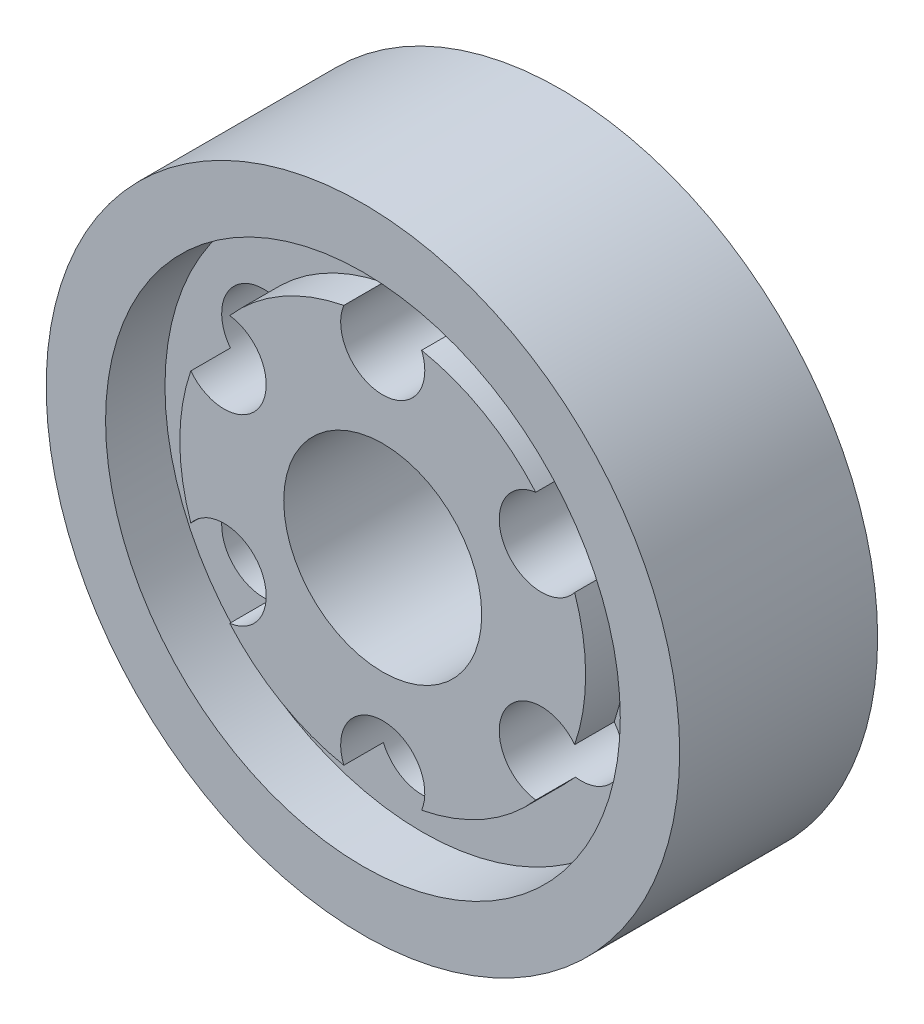
ISO-10303-21;
HEADER;
FILE_DESCRIPTION(('STEP AP214'),'2;1');
FILE_NAME('part.step','',(''),(''),'','','');
FILE_SCHEMA(('AUTOMOTIVE_DESIGN { 1 0 10303 214 1 1 1 1 }'));
ENDSEC;
DATA;
#1=APPLICATION_CONTEXT('core data for automotive mechanical design processes');
#2=APPLICATION_PROTOCOL_DEFINITION('international standard','automotive_design',2000,#1);
#3=PRODUCT_CONTEXT('',#1,'mechanical');
#4=PRODUCT('Part','Part','',(#3));
#5=PRODUCT_RELATED_PRODUCT_CATEGORY('part','',(#4));
#6=PRODUCT_DEFINITION_FORMATION('','',#4);
#7=PRODUCT_DEFINITION_CONTEXT('part definition',#1,'design');
#8=PRODUCT_DEFINITION('design','',#6,#7);
#9=PRODUCT_DEFINITION_SHAPE('','',#8);
#10=(LENGTH_UNIT() NAMED_UNIT(*) SI_UNIT(.MILLI.,.METRE.));
#11=(NAMED_UNIT(*) PLANE_ANGLE_UNIT() SI_UNIT($,.RADIAN.));
#12=(NAMED_UNIT(*) SI_UNIT($,.STERADIAN.) SOLID_ANGLE_UNIT());
#13=UNCERTAINTY_MEASURE_WITH_UNIT(LENGTH_MEASURE(1.E-05),#10,'distance_accuracy_value','');
#14=(GEOMETRIC_REPRESENTATION_CONTEXT(3) GLOBAL_UNCERTAINTY_ASSIGNED_CONTEXT((#13)) GLOBAL_UNIT_ASSIGNED_CONTEXT((#10,
#11,#12)) REPRESENTATION_CONTEXT('',''));
#15=CARTESIAN_POINT('',(0.,0.,0.));
#16=DIRECTION('',(0.,0.,1.));
#17=DIRECTION('',(1.,0.,0.));
#18=AXIS2_PLACEMENT_3D('',#15,#16,#17);
#19=CARTESIAN_POINT('',(0.,0.,18.));
#20=DIRECTION('',(0.,0.,-1.));
#21=DIRECTION('',(-1.,0.,0.));
#22=AXIS2_PLACEMENT_3D('',#19,#20,#21);
#23=CYLINDRICAL_SURFACE('',#22,20.5);
#24=CARTESIAN_POINT('',(0.,0.,14.));
#25=DIRECTION('',(0.,0.,1.));
#26=DIRECTION('',(1.,0.,0.));
#27=AXIS2_PLACEMENT_3D('',#24,#25,#26);
#28=CIRCLE('',#27,20.5);
#29=CARTESIAN_POINT('',(19.3889539201822,-6.65721156949741,14.));
#30=VERTEX_POINT('',#29);
#31=CARTESIAN_POINT('',(19.3889539201821,6.65721156949783,14.));
#32=VERTEX_POINT('',#31);
#33=EDGE_CURVE('E129',#30,#32,#28,.T.);
#34=ORIENTED_EDGE('',*,*,#33,.T.);
#35=DIRECTION('',(0.,0.,1.));
#36=VECTOR('',#35,1.);
#37=CARTESIAN_POINT('',(19.3889539201821,6.65721156949782,9.));
#38=LINE('',#37,#36);
#39=CARTESIAN_POINT('',(19.3889539201821,6.65721156949783,18.));
#40=VERTEX_POINT('',#39);
#41=EDGE_CURVE('E119',#32,#40,#38,.T.);
#42=ORIENTED_EDGE('',*,*,#41,.T.);
#43=CARTESIAN_POINT('',(0.,0.,18.));
#44=DIRECTION('',(0.,0.,1.));
#45=DIRECTION('',(1.,0.,0.));
#46=AXIS2_PLACEMENT_3D('',#43,#44,#45);
#47=CIRCLE('',#46,20.5);
#48=CARTESIAN_POINT('',(19.3889539201822,-6.65721156949742,18.));
#49=VERTEX_POINT('',#48);
#50=EDGE_CURVE('E127',#49,#40,#47,.T.);
#51=ORIENTED_EDGE('',*,*,#50,.F.);
#52=DIRECTION('',(0.,0.,1.));
#53=VECTOR('',#52,1.);
#54=CARTESIAN_POINT('',(19.3889539201822,-6.65721156949742,9.));
#55=LINE('',#54,#53);
#56=EDGE_CURVE('E54',#49,#30,#55,.F.);
#57=ORIENTED_EDGE('',*,*,#56,.T.);
#58=EDGE_LOOP('',(#34,#42,#51,#57));
#59=FACE_BOUND('',#58,.T.);
#60=ADVANCED_FACE('F32',(#59),#23,.T.);
#61=CARTESIAN_POINT('',(3.92916262253849,-20.1199324324324,14.));
#62=VERTEX_POINT('',#61);
#63=CARTESIAN_POINT('',(15.4597912976438,-13.4627208629347,14.));
#64=VERTEX_POINT('',#63);
#65=EDGE_CURVE('E182',#62,#64,#28,.T.);
#66=ORIENTED_EDGE('',*,*,#65,.T.);
#67=DIRECTION('',(0.,0.,1.));
#68=VECTOR('',#67,1.);
#69=CARTESIAN_POINT('',(15.4597912976438,-13.4627208629347,9.));
#70=LINE('',#69,#68);
#71=CARTESIAN_POINT('',(15.4597912976438,-13.4627208629347,18.));
#72=VERTEX_POINT('',#71);
#73=EDGE_CURVE('E174',#64,#72,#70,.T.);
#74=ORIENTED_EDGE('',*,*,#73,.T.);
#75=CARTESIAN_POINT('',(3.92916262253849,-20.1199324324324,18.));
#76=VERTEX_POINT('',#75);
#77=EDGE_CURVE('E136',#76,#72,#47,.T.);
#78=ORIENTED_EDGE('',*,*,#77,.F.);
#79=DIRECTION('',(0.,0.,1.));
#80=VECTOR('',#79,1.);
#81=CARTESIAN_POINT('',(3.92916262253849,-20.1199324324324,9.));
#82=LINE('',#81,#80);
#83=EDGE_CURVE('E195',#76,#62,#82,.F.);
#84=ORIENTED_EDGE('',*,*,#83,.T.);
#85=EDGE_LOOP('',(#66,#74,#78,#84));
#86=FACE_BOUND('',#85,.T.);
#87=ADVANCED_FACE('F179',(#86),#23,.T.);
#88=CARTESIAN_POINT('',(-15.4597912976436,-13.4627208629349,14.));
#89=VERTEX_POINT('',#88);
#90=CARTESIAN_POINT('',(-3.92916262253849,-20.1199324324324,14.));
#91=VERTEX_POINT('',#90);
#92=EDGE_CURVE('E201',#89,#91,#28,.T.);
#93=ORIENTED_EDGE('',*,*,#92,.T.);
#94=DIRECTION('',(0.,0.,1.));
#95=VECTOR('',#94,1.);
#96=CARTESIAN_POINT('',(-3.92916262253849,-20.1199324324324,9.));
#97=LINE('',#96,#95);
#98=CARTESIAN_POINT('',(-3.92916262253849,-20.1199324324324,18.));
#99=VERTEX_POINT('',#98);
#100=EDGE_CURVE('E193',#91,#99,#97,.T.);
#101=ORIENTED_EDGE('',*,*,#100,.T.);
#102=CARTESIAN_POINT('',(-15.4597912976436,-13.4627208629349,18.));
#103=VERTEX_POINT('',#102);
#104=EDGE_CURVE('E139',#103,#99,#47,.T.);
#105=ORIENTED_EDGE('',*,*,#104,.F.);
#106=DIRECTION('',(0.,0.,1.));
#107=VECTOR('',#106,1.);
#108=CARTESIAN_POINT('',(-15.4597912976436,-13.4627208629349,9.));
#109=LINE('',#108,#107);
#110=EDGE_CURVE('E206',#103,#89,#109,.F.);
#111=ORIENTED_EDGE('',*,*,#110,.T.);
#112=EDGE_LOOP('',(#93,#101,#105,#111));
#113=FACE_BOUND('',#112,.T.);
#114=ADVANCED_FACE('F198',(#113),#23,.T.);
#115=CARTESIAN_POINT('',(-19.3889539201822,6.65721156949755,14.));
#116=VERTEX_POINT('',#115);
#117=CARTESIAN_POINT('',(-19.3889539201821,-6.65721156949769,14.));
#118=VERTEX_POINT('',#117);
#119=EDGE_CURVE('E151',#116,#118,#28,.T.);
#120=ORIENTED_EDGE('',*,*,#119,.T.);
#121=DIRECTION('',(0.,0.,1.));
#122=VECTOR('',#121,1.);
#123=CARTESIAN_POINT('',(-19.3889539201821,-6.65721156949769,9.));
#124=LINE('',#123,#122);
#125=CARTESIAN_POINT('',(-19.3889539201821,-6.65721156949769,18.));
#126=VERTEX_POINT('',#125);
#127=EDGE_CURVE('E214',#118,#126,#124,.T.);
#128=ORIENTED_EDGE('',*,*,#127,.T.);
#129=CARTESIAN_POINT('',(-19.3889539201822,6.65721156949755,18.));
#130=VERTEX_POINT('',#129);
#131=EDGE_CURVE('E146',#130,#126,#47,.T.);
#132=ORIENTED_EDGE('',*,*,#131,.F.);
#133=DIRECTION('',(0.,0.,1.));
#134=VECTOR('',#133,1.);
#135=CARTESIAN_POINT('',(-19.3889539201822,6.65721156949755,9.));
#136=LINE('',#135,#134);
#137=EDGE_CURVE('E220',#130,#116,#136,.F.);
#138=ORIENTED_EDGE('',*,*,#137,.T.);
#139=EDGE_LOOP('',(#120,#128,#132,#138));
#140=FACE_BOUND('',#139,.T.);
#141=ADVANCED_FACE('F251',(#140),#23,.T.);
#142=CARTESIAN_POINT('',(-3.92916262253849,20.1199324324324,14.));
#143=VERTEX_POINT('',#142);
#144=CARTESIAN_POINT('',(-15.4597912976437,13.4627208629348,14.));
#145=VERTEX_POINT('',#144);
#146=EDGE_CURVE('E140',#143,#145,#28,.T.);
#147=ORIENTED_EDGE('',*,*,#146,.T.);
#148=DIRECTION('',(0.,0.,1.));
#149=VECTOR('',#148,1.);
#150=CARTESIAN_POINT('',(-15.4597912976437,13.4627208629348,9.));
#151=LINE('',#150,#149);
#152=CARTESIAN_POINT('',(-15.4597912976437,13.4627208629348,18.));
#153=VERTEX_POINT('',#152);
#154=EDGE_CURVE('E225',#145,#153,#151,.T.);
#155=ORIENTED_EDGE('',*,*,#154,.T.);
#156=CARTESIAN_POINT('',(-3.92916262253849,20.1199324324324,18.));
#157=VERTEX_POINT('',#156);
#158=EDGE_CURVE('E141',#157,#153,#47,.T.);
#159=ORIENTED_EDGE('',*,*,#158,.F.);
#160=DIRECTION('',(0.,0.,1.));
#161=VECTOR('',#160,1.);
#162=CARTESIAN_POINT('',(-3.92916262253849,20.1199324324324,9.));
#163=LINE('',#162,#161);
#164=EDGE_CURVE('E231',#157,#143,#163,.F.);
#165=ORIENTED_EDGE('',*,*,#164,.T.);
#166=EDGE_LOOP('',(#147,#155,#159,#165));
#167=FACE_BOUND('',#166,.T.);
#168=ADVANCED_FACE('F268',(#167),#23,.T.);
#169=CARTESIAN_POINT('',(0.,0.,14.));
#170=DIRECTION('',(0.,0.,1.));
#171=DIRECTION('',(1.,0.,0.));
#172=AXIS2_PLACEMENT_3D('',#169,#170,#171);
#173=PLANE('',#172);
#174=CARTESIAN_POINT('',(16.021469970012,9.25000000000019,14.));
#175=DIRECTION('',(0.,0.,1.));
#176=DIRECTION('',(1.,0.,0.));
#177=AXIS2_PLACEMENT_3D('',#174,#175,#176);
#178=CIRCLE('',#177,4.25);
#179=CARTESIAN_POINT('',(15.4597912976435,13.462720862935,14.));
#180=VERTEX_POINT('',#179);
#181=EDGE_CURVE('E131',#32,#180,#178,.T.);
#182=ORIENTED_EDGE('',*,*,#181,.F.);
#183=ORIENTED_EDGE('',*,*,#33,.F.);
#184=CARTESIAN_POINT('',(16.0214699700122,-9.24999999999985,14.));
#185=DIRECTION('',(0.,0.,1.));
#186=DIRECTION('',(1.,0.,0.));
#187=AXIS2_PLACEMENT_3D('',#184,#185,#186);
#188=CIRCLE('',#187,4.25);
#189=EDGE_CURVE('E184',#64,#30,#188,.T.);
#190=ORIENTED_EDGE('',*,*,#189,.F.);
#191=ORIENTED_EDGE('',*,*,#65,.F.);
#192=CARTESIAN_POINT('',(0.,-18.5,14.));
#193=DIRECTION('',(0.,0.,1.));
#194=DIRECTION('',(1.,0.,0.));
#195=AXIS2_PLACEMENT_3D('',#192,#193,#194);
#196=CIRCLE('',#195,4.25);
#197=EDGE_CURVE('E203',#91,#62,#196,.T.);
#198=ORIENTED_EDGE('',*,*,#197,.F.);
#199=ORIENTED_EDGE('',*,*,#92,.F.);
#200=CARTESIAN_POINT('',(-16.0214699700121,-9.25000000000008,14.));
#201=DIRECTION('',(0.,0.,1.));
#202=DIRECTION('',(1.,0.,0.));
#203=AXIS2_PLACEMENT_3D('',#200,#201,#202);
#204=CIRCLE('',#203,4.25);
#205=EDGE_CURVE('E212',#118,#89,#204,.T.);
#206=ORIENTED_EDGE('',*,*,#205,.F.);
#207=ORIENTED_EDGE('',*,*,#119,.F.);
#208=CARTESIAN_POINT('',(-16.0214699700121,9.24999999999996,14.));
#209=DIRECTION('',(0.,0.,1.));
#210=DIRECTION('',(1.,0.,0.));
#211=AXIS2_PLACEMENT_3D('',#208,#209,#210);
#212=CIRCLE('',#211,4.25);
#213=EDGE_CURVE('E223',#145,#116,#212,.T.);
#214=ORIENTED_EDGE('',*,*,#213,.F.);
#215=ORIENTED_EDGE('',*,*,#146,.F.);
#216=CARTESIAN_POINT('',(0.,18.5,14.));
#217=DIRECTION('',(0.,0.,1.));
#218=DIRECTION('',(1.,0.,0.));
#219=AXIS2_PLACEMENT_3D('',#216,#217,#218);
#220=CIRCLE('',#219,4.25);
#221=CARTESIAN_POINT('',(3.92916262253849,20.1199324324324,14.));
#222=VERTEX_POINT('',#221);
#223=EDGE_CURVE('E234',#222,#143,#220,.T.);
#224=ORIENTED_EDGE('',*,*,#223,.F.);
#225=EDGE_CURVE('E152',#180,#222,#28,.T.);
#226=ORIENTED_EDGE('',*,*,#225,.F.);
#227=EDGE_LOOP('',(#182,#183,#190,#191,#198,#199,#206,#207,#214,#215,#224,#226));
#228=FACE_BOUND('',#227,.T.);
#229=CARTESIAN_POINT('',(0.,0.,14.));
#230=DIRECTION('',(0.,0.,1.));
#231=DIRECTION('',(1.,0.,0.));
#232=AXIS2_PLACEMENT_3D('',#229,#230,#231);
#233=CIRCLE('',#232,26.);
#234=CARTESIAN_POINT('',(26.,0.,14.));
#235=VERTEX_POINT('',#234);
#236=EDGE_CURVE('E153',#235,#235,#233,.T.);
#237=ORIENTED_EDGE('',*,*,#236,.T.);
#238=EDGE_LOOP('',(#237));
#239=FACE_BOUND('',#238,.T.);
#240=ADVANCED_FACE('F257',(#228,#239),#173,.T.);
#241=CARTESIAN_POINT('',(0.,0.,20.));
#242=DIRECTION('',(0.,0.,-1.));
#243=DIRECTION('',(-1.,0.,0.));
#244=AXIS2_PLACEMENT_3D('',#241,#242,#243);
#245=CYLINDRICAL_SURFACE('',#244,32.);
#246=CARTESIAN_POINT('',(0.,0.,20.));
#247=DIRECTION('',(0.,0.,1.));
#248=DIRECTION('',(1.,0.,0.));
#249=AXIS2_PLACEMENT_3D('',#246,#247,#248);
#250=CIRCLE('',#249,32.);
#251=CARTESIAN_POINT('',(32.,0.,20.));
#252=VERTEX_POINT('',#251);
#253=EDGE_CURVE('E159',#252,#252,#250,.T.);
#254=ORIENTED_EDGE('',*,*,#253,.F.);
#255=EDGE_LOOP('',(#254));
#256=FACE_BOUND('',#255,.T.);
#257=CARTESIAN_POINT('',(0.,0.,0.));
#258=DIRECTION('',(0.,0.,1.));
#259=DIRECTION('',(1.,0.,0.));
#260=AXIS2_PLACEMENT_3D('',#257,#258,#259);
#261=CIRCLE('',#260,32.);
#262=CARTESIAN_POINT('',(32.,0.,0.));
#263=VERTEX_POINT('',#262);
#264=EDGE_CURVE('E156',#263,#263,#261,.T.);
#265=ORIENTED_EDGE('',*,*,#264,.T.);
#266=EDGE_LOOP('',(#265));
#267=FACE_BOUND('',#266,.T.);
#268=ADVANCED_FACE('F34',(#256,#267),#245,.T.);
#269=CARTESIAN_POINT('',(0.,0.,20.));
#270=DIRECTION('',(0.,0.,1.));
#271=DIRECTION('',(1.,0.,0.));
#272=AXIS2_PLACEMENT_3D('',#269,#270,#271);
#273=PLANE('',#272);
#274=CARTESIAN_POINT('',(0.,0.,20.));
#275=DIRECTION('',(0.,0.,1.));
#276=DIRECTION('',(1.,0.,0.));
#277=AXIS2_PLACEMENT_3D('',#274,#275,#276);
#278=CIRCLE('',#277,26.);
#279=CARTESIAN_POINT('',(26.,0.,20.));
#280=VERTEX_POINT('',#279);
#281=EDGE_CURVE('E145',#280,#280,#278,.T.);
#282=ORIENTED_EDGE('',*,*,#281,.F.);
#283=EDGE_LOOP('',(#282));
#284=FACE_BOUND('',#283,.T.);
#285=ORIENTED_EDGE('',*,*,#253,.T.);
#286=EDGE_LOOP('',(#285));
#287=FACE_BOUND('',#286,.T.);
#288=ADVANCED_FACE('F368',(#284,#287),#273,.T.);
#289=CARTESIAN_POINT('',(0.,0.,0.));
#290=DIRECTION('',(0.,0.,1.));
#291=DIRECTION('',(1.,0.,0.));
#292=AXIS2_PLACEMENT_3D('',#289,#290,#291);
#293=PLANE('',#292);
#294=CARTESIAN_POINT('',(16.021469970012,9.25000000000019,0.));
#295=DIRECTION('',(0.,0.,1.));
#296=DIRECTION('',(0.50000000000001,-0.866025403784433,0.));
#297=AXIS2_PLACEMENT_3D('',#294,#295,#296);
#298=CIRCLE('',#297,4.25);
#299=CARTESIAN_POINT('',(18.1464699700121,5.56939203391635,0.));
#300=VERTEX_POINT('',#299);
#301=EDGE_CURVE('E273',#300,#300,#298,.T.);
#302=ORIENTED_EDGE('',*,*,#301,.T.);
#303=EDGE_LOOP('',(#302));
#304=FACE_BOUND('',#303,.T.);
#305=CARTESIAN_POINT('',(16.0214699700122,-9.24999999999985,0.));
#306=DIRECTION('',(0.,0.,1.));
#307=DIRECTION('',(-0.499999999999992,-0.866025403784443,0.));
#308=AXIS2_PLACEMENT_3D('',#305,#306,#307);
#309=CIRCLE('',#308,4.25);
#310=CARTESIAN_POINT('',(13.8964699700122,-12.9306079660837,0.));
#311=VERTEX_POINT('',#310);
#312=EDGE_CURVE('E130',#311,#311,#309,.T.);
#313=ORIENTED_EDGE('',*,*,#312,.T.);
#314=EDGE_LOOP('',(#313));
#315=FACE_BOUND('',#314,.T.);
#316=CARTESIAN_POINT('',(0.,-18.5,0.));
#317=DIRECTION('',(0.,0.,1.));
#318=DIRECTION('',(-1.,0.,0.));
#319=AXIS2_PLACEMENT_3D('',#316,#317,#318);
#320=CIRCLE('',#319,4.25);
#321=CARTESIAN_POINT('',(-4.25,-18.5,0.));
#322=VERTEX_POINT('',#321);
#323=EDGE_CURVE('E183',#322,#322,#320,.T.);
#324=ORIENTED_EDGE('',*,*,#323,.T.);
#325=EDGE_LOOP('',(#324));
#326=FACE_BOUND('',#325,.T.);
#327=CARTESIAN_POINT('',(-16.0214699700121,-9.25000000000008,0.));
#328=DIRECTION('',(0.,0.,1.));
#329=DIRECTION('',(-0.500000000000004,0.866025403784436,0.));
#330=AXIS2_PLACEMENT_3D('',#327,#328,#329);
#331=CIRCLE('',#330,4.25);
#332=CARTESIAN_POINT('',(-18.1464699700121,-5.56939203391622,0.));
#333=VERTEX_POINT('',#332);
#334=EDGE_CURVE('E202',#333,#333,#331,.T.);
#335=ORIENTED_EDGE('',*,*,#334,.T.);
#336=EDGE_LOOP('',(#335));
#337=FACE_BOUND('',#336,.T.);
#338=CARTESIAN_POINT('',(-16.0214699700121,9.24999999999996,0.));
#339=DIRECTION('',(0.,0.,1.));
#340=DIRECTION('',(0.499999999999998,0.86602540378444,0.));
#341=AXIS2_PLACEMENT_3D('',#338,#339,#340);
#342=CIRCLE('',#341,4.25);
#343=CARTESIAN_POINT('',(-13.8964699700121,12.9306079660838,0.));
#344=VERTEX_POINT('',#343);
#345=EDGE_CURVE('E217',#344,#344,#342,.T.);
#346=ORIENTED_EDGE('',*,*,#345,.T.);
#347=EDGE_LOOP('',(#346));
#348=FACE_BOUND('',#347,.T.);
#349=CARTESIAN_POINT('',(0.,18.5,0.));
#350=DIRECTION('',(0.,0.,1.));
#351=DIRECTION('',(1.,0.,0.));
#352=AXIS2_PLACEMENT_3D('',#349,#350,#351);
#353=CIRCLE('',#352,4.25);
#354=CARTESIAN_POINT('',(4.25,18.5,0.));
#355=VERTEX_POINT('',#354);
#356=EDGE_CURVE('E228',#355,#355,#353,.T.);
#357=ORIENTED_EDGE('',*,*,#356,.T.);
#358=EDGE_LOOP('',(#357));
#359=FACE_BOUND('',#358,.T.);
#360=CARTESIAN_POINT('',(0.,0.,0.));
#361=DIRECTION('',(0.,0.,1.));
#362=DIRECTION('',(1.,0.,0.));
#363=AXIS2_PLACEMENT_3D('',#360,#361,#362);
#364=CIRCLE('',#363,10.);
#365=CARTESIAN_POINT('',(10.,0.,0.));
#366=VERTEX_POINT('',#365);
#367=EDGE_CURVE('E147',#366,#366,#364,.T.);
#368=ORIENTED_EDGE('',*,*,#367,.T.);
#369=EDGE_LOOP('',(#368));
#370=FACE_BOUND('',#369,.T.);
#371=ORIENTED_EDGE('',*,*,#264,.F.);
#372=EDGE_LOOP('',(#371));
#373=FACE_BOUND('',#372,.T.);
#374=ADVANCED_FACE('F286',(#304,#315,#326,#337,#348,#359,#370,#373),#293,.F.);
#375=CARTESIAN_POINT('',(0.,0.,14.));
#376=DIRECTION('',(0.,0.,1.));
#377=DIRECTION('',(1.,0.,0.));
#378=AXIS2_PLACEMENT_3D('',#375,#376,#377);
#379=CYLINDRICAL_SURFACE('',#378,26.);
#380=ORIENTED_EDGE('',*,*,#236,.F.);
#381=EDGE_LOOP('',(#380));
#382=FACE_BOUND('',#381,.T.);
#383=ORIENTED_EDGE('',*,*,#281,.T.);
#384=EDGE_LOOP('',(#383));
#385=FACE_BOUND('',#384,.T.);
#386=ADVANCED_FACE('F307',(#382,#385),#379,.F.);
#387=CARTESIAN_POINT('',(15.4597912976435,13.462720862935,18.));
#388=VERTEX_POINT('',#387);
#389=CARTESIAN_POINT('',(3.92916262253849,20.1199324324324,18.));
#390=VERTEX_POINT('',#389);
#391=EDGE_CURVE('E137',#388,#390,#47,.T.);
#392=ORIENTED_EDGE('',*,*,#391,.F.);
#393=DIRECTION('',(0.,0.,1.));
#394=VECTOR('',#393,1.);
#395=CARTESIAN_POINT('',(15.4597912976435,13.462720862935,9.));
#396=LINE('',#395,#394);
#397=EDGE_CURVE('E46',#388,#180,#396,.F.);
#398=ORIENTED_EDGE('',*,*,#397,.T.);
#399=ORIENTED_EDGE('',*,*,#225,.T.);
#400=DIRECTION('',(0.,0.,1.));
#401=VECTOR('',#400,1.);
#402=CARTESIAN_POINT('',(3.92916262253849,20.1199324324324,9.));
#403=LINE('',#402,#401);
#404=EDGE_CURVE('E236',#222,#390,#403,.T.);
#405=ORIENTED_EDGE('',*,*,#404,.T.);
#406=EDGE_LOOP('',(#392,#398,#399,#405));
#407=FACE_BOUND('',#406,.T.);
#408=ADVANCED_FACE('F272',(#407),#23,.T.);
#409=CARTESIAN_POINT('',(0.,0.,18.));
#410=DIRECTION('',(0.,0.,1.));
#411=DIRECTION('',(1.,0.,0.));
#412=AXIS2_PLACEMENT_3D('',#409,#410,#411);
#413=PLANE('',#412);
#414=CARTESIAN_POINT('',(16.021469970012,9.25000000000019,18.));
#415=DIRECTION('',(0.,0.,1.));
#416=DIRECTION('',(1.,0.,0.));
#417=AXIS2_PLACEMENT_3D('',#414,#415,#416);
#418=CIRCLE('',#417,4.25);
#419=EDGE_CURVE('E11',#388,#40,#418,.T.);
#420=ORIENTED_EDGE('',*,*,#419,.F.);
#421=ORIENTED_EDGE('',*,*,#391,.T.);
#422=CARTESIAN_POINT('',(0.,18.5,18.));
#423=DIRECTION('',(0.,0.,1.));
#424=DIRECTION('',(1.,0.,0.));
#425=AXIS2_PLACEMENT_3D('',#422,#423,#424);
#426=CIRCLE('',#425,4.25);
#427=EDGE_CURVE('E162',#157,#390,#426,.T.);
#428=ORIENTED_EDGE('',*,*,#427,.F.);
#429=ORIENTED_EDGE('',*,*,#158,.T.);
#430=CARTESIAN_POINT('',(-16.0214699700121,9.24999999999996,18.));
#431=DIRECTION('',(0.,0.,1.));
#432=DIRECTION('',(1.,0.,0.));
#433=AXIS2_PLACEMENT_3D('',#430,#431,#432);
#434=CIRCLE('',#433,4.25);
#435=EDGE_CURVE('E167',#130,#153,#434,.T.);
#436=ORIENTED_EDGE('',*,*,#435,.F.);
#437=ORIENTED_EDGE('',*,*,#131,.T.);
#438=CARTESIAN_POINT('',(-16.0214699700121,-9.25000000000008,18.));
#439=DIRECTION('',(0.,0.,1.));
#440=DIRECTION('',(1.,0.,0.));
#441=AXIS2_PLACEMENT_3D('',#438,#439,#440);
#442=CIRCLE('',#441,4.25);
#443=EDGE_CURVE('E169',#103,#126,#442,.T.);
#444=ORIENTED_EDGE('',*,*,#443,.F.);
#445=ORIENTED_EDGE('',*,*,#104,.T.);
#446=CARTESIAN_POINT('',(0.,-18.5,18.));
#447=DIRECTION('',(0.,0.,1.));
#448=DIRECTION('',(1.,0.,0.));
#449=AXIS2_PLACEMENT_3D('',#446,#447,#448);
#450=CIRCLE('',#449,4.25);
#451=EDGE_CURVE('E171',#76,#99,#450,.T.);
#452=ORIENTED_EDGE('',*,*,#451,.F.);
#453=ORIENTED_EDGE('',*,*,#77,.T.);
#454=CARTESIAN_POINT('',(16.0214699700122,-9.24999999999985,18.));
#455=DIRECTION('',(0.,0.,1.));
#456=DIRECTION('',(1.,0.,0.));
#457=AXIS2_PLACEMENT_3D('',#454,#455,#456);
#458=CIRCLE('',#457,4.25);
#459=EDGE_CURVE('E40',#49,#72,#458,.T.);
#460=ORIENTED_EDGE('',*,*,#459,.F.);
#461=ORIENTED_EDGE('',*,*,#50,.T.);
#462=EDGE_LOOP('',(#420,#421,#428,#429,#436,#437,#444,#445,#452,#453,#460,#461));
#463=FACE_BOUND('',#462,.T.);
#464=CARTESIAN_POINT('',(0.,0.,18.));
#465=DIRECTION('',(0.,0.,1.));
#466=DIRECTION('',(1.,0.,0.));
#467=AXIS2_PLACEMENT_3D('',#464,#465,#466);
#468=CIRCLE('',#467,10.);
#469=CARTESIAN_POINT('',(10.,0.,18.));
#470=VERTEX_POINT('',#469);
#471=EDGE_CURVE('E238',#470,#470,#468,.T.);
#472=ORIENTED_EDGE('',*,*,#471,.F.);
#473=EDGE_LOOP('',(#472));
#474=FACE_BOUND('',#473,.T.);
#475=ADVANCED_FACE('F133',(#463,#474),#413,.T.);
#476=CARTESIAN_POINT('',(0.,0.,-64.));
#477=DIRECTION('',(0.,0.,1.));
#478=DIRECTION('',(1.,0.,0.));
#479=AXIS2_PLACEMENT_3D('',#476,#477,#478);
#480=CYLINDRICAL_SURFACE('',#479,10.);
#481=ORIENTED_EDGE('',*,*,#471,.T.);
#482=EDGE_LOOP('',(#481));
#483=FACE_BOUND('',#482,.T.);
#484=ORIENTED_EDGE('',*,*,#367,.F.);
#485=EDGE_LOOP('',(#484));
#486=FACE_BOUND('',#485,.T.);
#487=ADVANCED_FACE('F312',(#483,#486),#480,.F.);
#488=CARTESIAN_POINT('',(0.,18.5,0.));
#489=DIRECTION('',(0.,0.,1.));
#490=DIRECTION('',(1.,0.,0.));
#491=AXIS2_PLACEMENT_3D('',#488,#489,#490);
#492=CYLINDRICAL_SURFACE('',#491,4.25);
#493=ORIENTED_EDGE('',*,*,#356,.F.);
#494=EDGE_LOOP('',(#493));
#495=FACE_BOUND('',#494,.T.);
#496=ORIENTED_EDGE('',*,*,#223,.T.);
#497=ORIENTED_EDGE('',*,*,#164,.F.);
#498=ORIENTED_EDGE('',*,*,#427,.T.);
#499=ORIENTED_EDGE('',*,*,#404,.F.);
#500=EDGE_LOOP('',(#496,#497,#498,#499));
#501=FACE_BOUND('',#500,.T.);
#502=ADVANCED_FACE('F271',(#495,#501),#492,.F.);
#503=CARTESIAN_POINT('',(-16.0214699700121,9.24999999999996,0.));
#504=DIRECTION('',(0.,0.,1.));
#505=DIRECTION('',(1.,0.,0.));
#506=AXIS2_PLACEMENT_3D('',#503,#504,#505);
#507=CYLINDRICAL_SURFACE('',#506,4.25);
#508=ORIENTED_EDGE('',*,*,#345,.F.);
#509=EDGE_LOOP('',(#508));
#510=FACE_BOUND('',#509,.T.);
#511=ORIENTED_EDGE('',*,*,#213,.T.);
#512=ORIENTED_EDGE('',*,*,#137,.F.);
#513=ORIENTED_EDGE('',*,*,#435,.T.);
#514=ORIENTED_EDGE('',*,*,#154,.F.);
#515=EDGE_LOOP('',(#511,#512,#513,#514));
#516=FACE_BOUND('',#515,.T.);
#517=ADVANCED_FACE('F266',(#510,#516),#507,.F.);
#518=CARTESIAN_POINT('',(-16.0214699700121,-9.25000000000008,0.));
#519=DIRECTION('',(0.,0.,1.));
#520=DIRECTION('',(1.,0.,0.));
#521=AXIS2_PLACEMENT_3D('',#518,#519,#520);
#522=CYLINDRICAL_SURFACE('',#521,4.25);
#523=ORIENTED_EDGE('',*,*,#334,.F.);
#524=EDGE_LOOP('',(#523));
#525=FACE_BOUND('',#524,.T.);
#526=ORIENTED_EDGE('',*,*,#205,.T.);
#527=ORIENTED_EDGE('',*,*,#110,.F.);
#528=ORIENTED_EDGE('',*,*,#443,.T.);
#529=ORIENTED_EDGE('',*,*,#127,.F.);
#530=EDGE_LOOP('',(#526,#527,#528,#529));
#531=FACE_BOUND('',#530,.T.);
#532=ADVANCED_FACE('F261',(#525,#531),#522,.F.);
#533=CARTESIAN_POINT('',(0.,-18.5,0.));
#534=DIRECTION('',(0.,0.,1.));
#535=DIRECTION('',(1.,0.,0.));
#536=AXIS2_PLACEMENT_3D('',#533,#534,#535);
#537=CYLINDRICAL_SURFACE('',#536,4.25);
#538=ORIENTED_EDGE('',*,*,#323,.F.);
#539=EDGE_LOOP('',(#538));
#540=FACE_BOUND('',#539,.T.);
#541=ORIENTED_EDGE('',*,*,#197,.T.);
#542=ORIENTED_EDGE('',*,*,#83,.F.);
#543=ORIENTED_EDGE('',*,*,#451,.T.);
#544=ORIENTED_EDGE('',*,*,#100,.F.);
#545=EDGE_LOOP('',(#541,#542,#543,#544));
#546=FACE_BOUND('',#545,.T.);
#547=ADVANCED_FACE('F192',(#540,#546),#537,.F.);
#548=CARTESIAN_POINT('',(16.0214699700122,-9.24999999999985,0.));
#549=DIRECTION('',(0.,0.,1.));
#550=DIRECTION('',(1.,0.,0.));
#551=AXIS2_PLACEMENT_3D('',#548,#549,#550);
#552=CYLINDRICAL_SURFACE('',#551,4.25);
#553=ORIENTED_EDGE('',*,*,#312,.F.);
#554=EDGE_LOOP('',(#553));
#555=FACE_BOUND('',#554,.T.);
#556=ORIENTED_EDGE('',*,*,#189,.T.);
#557=ORIENTED_EDGE('',*,*,#56,.F.);
#558=ORIENTED_EDGE('',*,*,#459,.T.);
#559=ORIENTED_EDGE('',*,*,#73,.F.);
#560=EDGE_LOOP('',(#556,#557,#558,#559));
#561=FACE_BOUND('',#560,.T.);
#562=ADVANCED_FACE('F173',(#555,#561),#552,.F.);
#563=CARTESIAN_POINT('',(16.021469970012,9.25000000000019,0.));
#564=DIRECTION('',(0.,0.,1.));
#565=DIRECTION('',(1.,0.,0.));
#566=AXIS2_PLACEMENT_3D('',#563,#564,#565);
#567=CYLINDRICAL_SURFACE('',#566,4.25);
#568=ORIENTED_EDGE('',*,*,#301,.F.);
#569=EDGE_LOOP('',(#568));
#570=FACE_BOUND('',#569,.T.);
#571=ORIENTED_EDGE('',*,*,#181,.T.);
#572=ORIENTED_EDGE('',*,*,#397,.F.);
#573=ORIENTED_EDGE('',*,*,#419,.T.);
#574=ORIENTED_EDGE('',*,*,#41,.F.);
#575=EDGE_LOOP('',(#571,#572,#573,#574));
#576=FACE_BOUND('',#575,.T.);
#577=ADVANCED_FACE('F118',(#570,#576),#567,.F.);
#578=CLOSED_SHELL('',(#60,#87,#114,#141,#168,#240,#268,#288,#374,#386,#408,#475,#487,#502,#517,
#532,#547,#562,#577));
#579=MANIFOLD_SOLID_BREP('B2',#578);
#580=ADVANCED_BREP_SHAPE_REPRESENTATION('',(#18,#579),#14);
#581=SHAPE_DEFINITION_REPRESENTATION(#9,#580);
ENDSEC;
END-ISO-10303-21;
